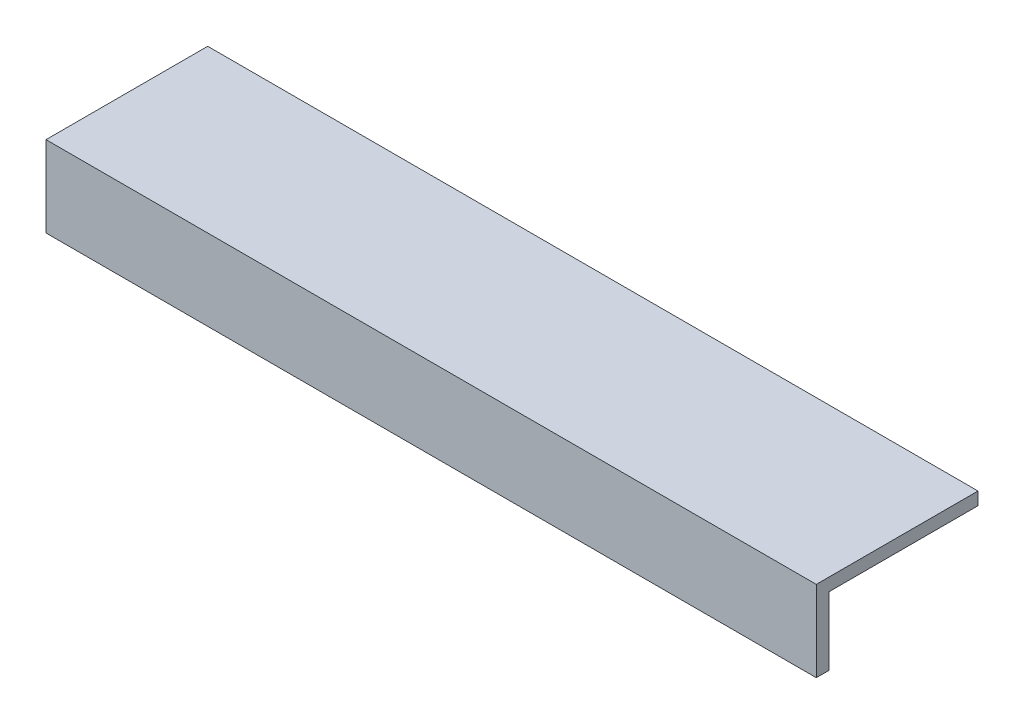
ISO-10303-21;
HEADER;
FILE_DESCRIPTION(('STEP AP214'),'2;1');
FILE_NAME('part.step','',(''),(''),'','','');
FILE_SCHEMA(('AUTOMOTIVE_DESIGN { 1 0 10303 214 1 1 1 1 }'));
ENDSEC;
DATA;
#1=APPLICATION_CONTEXT('core data for automotive mechanical design processes');
#2=APPLICATION_PROTOCOL_DEFINITION('international standard','automotive_design',2000,#1);
#3=PRODUCT_CONTEXT('',#1,'mechanical');
#4=PRODUCT('Part','Part','',(#3));
#5=PRODUCT_RELATED_PRODUCT_CATEGORY('part','',(#4));
#6=PRODUCT_DEFINITION_FORMATION('','',#4);
#7=PRODUCT_DEFINITION_CONTEXT('part definition',#1,'design');
#8=PRODUCT_DEFINITION('design','',#6,#7);
#9=PRODUCT_DEFINITION_SHAPE('','',#8);
#10=(LENGTH_UNIT() NAMED_UNIT(*) SI_UNIT(.MILLI.,.METRE.));
#11=(NAMED_UNIT(*) PLANE_ANGLE_UNIT() SI_UNIT($,.RADIAN.));
#12=(NAMED_UNIT(*) SI_UNIT($,.STERADIAN.) SOLID_ANGLE_UNIT());
#13=UNCERTAINTY_MEASURE_WITH_UNIT(LENGTH_MEASURE(1.E-05),#10,'distance_accuracy_value','');
#14=(GEOMETRIC_REPRESENTATION_CONTEXT(3) GLOBAL_UNCERTAINTY_ASSIGNED_CONTEXT((#13)) GLOBAL_UNIT_ASSIGNED_CONTEXT((#10,
#11,#12)) REPRESENTATION_CONTEXT('',''));
#15=CARTESIAN_POINT('',(0.,0.,0.));
#16=DIRECTION('',(0.,0.,1.));
#17=DIRECTION('',(1.,0.,0.));
#18=AXIS2_PLACEMENT_3D('',#15,#16,#17);
#19=CARTESIAN_POINT('',(181.000000000002,-7.49400541621981E-13,0.));
#20=DIRECTION('',(0.,-0.999999999999991,0.));
#21=DIRECTION('',(0.,0.,-0.99999999999999));
#22=AXIS2_PLACEMENT_3D('',#19,#20,#21);
#23=PLANE('',#22);
#24=DIRECTION('',(0.,0.,0.99999999999999));
#25=VECTOR('',#24,1.);
#26=CARTESIAN_POINT('',(0.,0.,0.));
#27=LINE('',#26,#25);
#28=CARTESIAN_POINT('',(-2.4980018054066E-13,-3.33066907387547E-13,-38.0000000000003));
#29=VERTEX_POINT('',#28);
#30=CARTESIAN_POINT('',(0.,0.,0.));
#31=VERTEX_POINT('',#30);
#32=EDGE_CURVE('E121',#29,#31,#27,.T.);
#33=ORIENTED_EDGE('',*,*,#32,.T.);
#34=DIRECTION('',(-0.999999999999998,0.,0.));
#35=VECTOR('',#34,1.);
#36=CARTESIAN_POINT('',(181.000000000002,-7.49400541621981E-13,0.));
#37=LINE('',#36,#35);
#38=CARTESIAN_POINT('',(181.000000000002,-7.49400541621981E-13,0.));
#39=VERTEX_POINT('',#38);
#40=EDGE_CURVE('E11',#39,#31,#37,.T.);
#41=ORIENTED_EDGE('',*,*,#40,.F.);
#42=DIRECTION('',(0.,0.,0.99999999999999));
#43=VECTOR('',#42,1.);
#44=CARTESIAN_POINT('',(181.000000000002,-7.49400541621981E-13,0.));
#45=LINE('',#44,#43);
#46=CARTESIAN_POINT('',(181.,-1.94289029309402E-13,-38.0000000000002));
#47=VERTEX_POINT('',#46);
#48=EDGE_CURVE('E110',#47,#39,#45,.T.);
#49=ORIENTED_EDGE('',*,*,#48,.F.);
#50=DIRECTION('',(-0.999999999999998,0.,0.));
#51=VECTOR('',#50,1.);
#52=CARTESIAN_POINT('',(181.,-1.94289029309402E-13,-38.0000000000002));
#53=LINE('',#52,#51);
#54=EDGE_CURVE('E120',#47,#29,#53,.T.);
#55=ORIENTED_EDGE('',*,*,#54,.T.);
#56=EDGE_LOOP('',(#33,#41,#49,#55));
#57=FACE_BOUND('',#56,.T.);
#58=ADVANCED_FACE('F38',(#57),#23,.F.);
#59=CARTESIAN_POINT('',(181.000000000002,-7.49400541621981E-13,0.));
#60=DIRECTION('',(0.,0.,-0.99999999999999));
#61=DIRECTION('',(-0.999999999999998,0.,0.));
#62=AXIS2_PLACEMENT_3D('',#59,#60,#61);
#63=PLANE('',#62);
#64=DIRECTION('',(0.,-0.999999999999991,0.));
#65=VECTOR('',#64,1.);
#66=CARTESIAN_POINT('',(0.,0.,0.));
#67=LINE('',#66,#65);
#68=CARTESIAN_POINT('',(0.,-18.9999999999999,-1.11022302462516E-13));
#69=VERTEX_POINT('',#68);
#70=EDGE_CURVE('E106',#31,#69,#67,.T.);
#71=ORIENTED_EDGE('',*,*,#70,.T.);
#72=DIRECTION('',(-0.999999999999998,0.,0.));
#73=VECTOR('',#72,1.);
#74=CARTESIAN_POINT('',(0.,-18.9999999999999,-1.11022302462516E-13));
#75=LINE('',#74,#73);
#76=CARTESIAN_POINT('',(181.000000000001,-19.0000000000003,1.66533453693773E-13));
#77=VERTEX_POINT('',#76);
#78=EDGE_CURVE('E52',#77,#69,#75,.T.);
#79=ORIENTED_EDGE('',*,*,#78,.F.);
#80=DIRECTION('',(0.,-0.999999999999991,0.));
#81=VECTOR('',#80,1.);
#82=CARTESIAN_POINT('',(181.000000000002,-7.49400541621981E-13,0.));
#83=LINE('',#82,#81);
#84=EDGE_CURVE('E88',#39,#77,#83,.T.);
#85=ORIENTED_EDGE('',*,*,#84,.F.);
#86=ORIENTED_EDGE('',*,*,#40,.T.);
#87=EDGE_LOOP('',(#71,#79,#85,#86));
#88=FACE_BOUND('',#87,.T.);
#89=ADVANCED_FACE('F105',(#88),#63,.F.);
#90=CARTESIAN_POINT('',(181.,-2.99999999999992,-2.99999999999989));
#91=DIRECTION('',(0.,0.,0.99999999999999));
#92=DIRECTION('',(0.999999999999998,0.,0.));
#93=AXIS2_PLACEMENT_3D('',#90,#91,#92);
#94=PLANE('',#93);
#95=DIRECTION('',(0.,0.999999999999991,0.));
#96=VECTOR('',#95,1.);
#97=CARTESIAN_POINT('',(181.,-2.99999999999992,-2.99999999999989));
#98=LINE('',#97,#96);
#99=CARTESIAN_POINT('',(181.,-18.9999999999998,-3.00000000000017));
#100=VERTEX_POINT('',#99);
#101=CARTESIAN_POINT('',(181.,-2.99999999999992,-2.99999999999989));
#102=VERTEX_POINT('',#101);
#103=EDGE_CURVE('E112',#100,#102,#98,.T.);
#104=ORIENTED_EDGE('',*,*,#103,.F.);
#105=DIRECTION('',(0.999999999999998,0.,0.));
#106=VECTOR('',#105,1.);
#107=CARTESIAN_POINT('',(0.,-19.,-2.99999999999995));
#108=LINE('',#107,#106);
#109=CARTESIAN_POINT('',(0.,-19.,-2.99999999999995));
#110=VERTEX_POINT('',#109);
#111=EDGE_CURVE('E100',#110,#100,#108,.T.);
#112=ORIENTED_EDGE('',*,*,#111,.F.);
#113=DIRECTION('',(0.,0.999999999999991,0.));
#114=VECTOR('',#113,1.);
#115=CARTESIAN_POINT('',(0.,-3.00000000000031,-3.00000000000028));
#116=LINE('',#115,#114);
#117=CARTESIAN_POINT('',(0.,-3.00000000000031,-3.00000000000028));
#118=VERTEX_POINT('',#117);
#119=EDGE_CURVE('E125',#110,#118,#116,.T.);
#120=ORIENTED_EDGE('',*,*,#119,.T.);
#121=DIRECTION('',(-0.999999999999998,0.,0.));
#122=VECTOR('',#121,1.);
#123=CARTESIAN_POINT('',(181.,-2.99999999999992,-2.99999999999989));
#124=LINE('',#123,#122);
#125=EDGE_CURVE('E45',#102,#118,#124,.T.);
#126=ORIENTED_EDGE('',*,*,#125,.F.);
#127=EDGE_LOOP('',(#104,#112,#120,#126));
#128=FACE_BOUND('',#127,.T.);
#129=ADVANCED_FACE('F153',(#128),#94,.F.);
#130=CARTESIAN_POINT('',(181.,-2.99999999999992,-2.99999999999989));
#131=DIRECTION('',(0.,0.999999999999991,0.));
#132=DIRECTION('',(0.,0.,0.99999999999999));
#133=AXIS2_PLACEMENT_3D('',#130,#131,#132);
#134=PLANE('',#133);
#135=DIRECTION('',(0.,0.,-0.99999999999999));
#136=VECTOR('',#135,1.);
#137=CARTESIAN_POINT('',(0.,-3.00000000000031,-3.00000000000028));
#138=LINE('',#137,#136);
#139=CARTESIAN_POINT('',(-1.38777878078145E-13,-3.00000000000009,-38.));
#140=VERTEX_POINT('',#139);
#141=EDGE_CURVE('E127',#118,#140,#138,.T.);
#142=ORIENTED_EDGE('',*,*,#141,.T.);
#143=DIRECTION('',(-0.999999999999998,0.,0.));
#144=VECTOR('',#143,1.);
#145=CARTESIAN_POINT('',(181.,-3.00000000000014,-38.0000000000001));
#146=LINE('',#145,#144);
#147=CARTESIAN_POINT('',(181.,-3.00000000000014,-38.0000000000001));
#148=VERTEX_POINT('',#147);
#149=EDGE_CURVE('E131',#148,#140,#146,.T.);
#150=ORIENTED_EDGE('',*,*,#149,.F.);
#151=DIRECTION('',(0.,0.,-0.99999999999999));
#152=VECTOR('',#151,1.);
#153=CARTESIAN_POINT('',(181.,-2.99999999999992,-2.99999999999989));
#154=LINE('',#153,#152);
#155=EDGE_CURVE('E114',#102,#148,#154,.T.);
#156=ORIENTED_EDGE('',*,*,#155,.F.);
#157=ORIENTED_EDGE('',*,*,#125,.T.);
#158=EDGE_LOOP('',(#142,#150,#156,#157));
#159=FACE_BOUND('',#158,.T.);
#160=ADVANCED_FACE('F137',(#159),#134,.F.);
#161=CARTESIAN_POINT('',(181.,-1.94289029309402E-13,-38.0000000000002));
#162=DIRECTION('',(0.,0.,0.99999999999999));
#163=DIRECTION('',(0.999999999999998,0.,0.));
#164=AXIS2_PLACEMENT_3D('',#161,#162,#163);
#165=PLANE('',#164);
#166=DIRECTION('',(0.,0.999999999999991,0.));
#167=VECTOR('',#166,1.);
#168=CARTESIAN_POINT('',(-2.4980018054066E-13,-3.33066907387547E-13,-38.0000000000003));
#169=LINE('',#168,#167);
#170=EDGE_CURVE('E82',#140,#29,#169,.T.);
#171=ORIENTED_EDGE('',*,*,#170,.T.);
#172=ORIENTED_EDGE('',*,*,#54,.F.);
#173=DIRECTION('',(0.,0.999999999999991,0.));
#174=VECTOR('',#173,1.);
#175=CARTESIAN_POINT('',(181.,-1.94289029309402E-13,-38.0000000000002));
#176=LINE('',#175,#174);
#177=EDGE_CURVE('E61',#148,#47,#176,.T.);
#178=ORIENTED_EDGE('',*,*,#177,.F.);
#179=ORIENTED_EDGE('',*,*,#149,.T.);
#180=EDGE_LOOP('',(#171,#172,#178,#179));
#181=FACE_BOUND('',#180,.T.);
#182=ADVANCED_FACE('F145',(#181),#165,.F.);
#183=CARTESIAN_POINT('',(181.000000000002,-7.49400541621981E-13,0.));
#184=DIRECTION('',(-0.999999999999998,0.,0.));
#185=DIRECTION('',(0.,0.,0.99999999999999));
#186=AXIS2_PLACEMENT_3D('',#183,#184,#185);
#187=PLANE('',#186);
#188=ORIENTED_EDGE('',*,*,#84,.T.);
#189=DIRECTION('',(0.,0.,0.99999999999999));
#190=VECTOR('',#189,1.);
#191=CARTESIAN_POINT('',(181.,-19.0000000000005,-184.994505411564));
#192=LINE('',#191,#190);
#193=EDGE_CURVE('E97',#100,#77,#192,.T.);
#194=ORIENTED_EDGE('',*,*,#193,.F.);
#195=ORIENTED_EDGE('',*,*,#103,.T.);
#196=ORIENTED_EDGE('',*,*,#155,.T.);
#197=ORIENTED_EDGE('',*,*,#177,.T.);
#198=ORIENTED_EDGE('',*,*,#48,.T.);
#199=EDGE_LOOP('',(#188,#194,#195,#196,#197,#198));
#200=FACE_BOUND('',#199,.T.);
#201=ADVANCED_FACE('F108',(#200),#187,.F.);
#202=CARTESIAN_POINT('',(0.,0.,0.));
#203=DIRECTION('',(-0.999999999999998,0.,0.));
#204=DIRECTION('',(0.,0.,0.99999999999999));
#205=AXIS2_PLACEMENT_3D('',#202,#203,#204);
#206=PLANE('',#205);
#207=DIRECTION('',(0.,0.,0.99999999999999));
#208=VECTOR('',#207,1.);
#209=CARTESIAN_POINT('',(0.,-18.9999999999999,-184.994505411564));
#210=LINE('',#209,#208);
#211=EDGE_CURVE('E102',#110,#69,#210,.T.);
#212=ORIENTED_EDGE('',*,*,#211,.T.);
#213=ORIENTED_EDGE('',*,*,#70,.F.);
#214=ORIENTED_EDGE('',*,*,#32,.F.);
#215=ORIENTED_EDGE('',*,*,#170,.F.);
#216=ORIENTED_EDGE('',*,*,#141,.F.);
#217=ORIENTED_EDGE('',*,*,#119,.F.);
#218=EDGE_LOOP('',(#212,#213,#214,#215,#216,#217));
#219=FACE_BOUND('',#218,.T.);
#220=ADVANCED_FACE('F142',(#219),#206,.T.);
#221=CARTESIAN_POINT('',(0.,-18.9999999999999,-184.994505411564));
#222=DIRECTION('',(0.,0.999999999999991,0.));
#223=DIRECTION('',(0.,0.,0.99999999999999));
#224=AXIS2_PLACEMENT_3D('',#221,#222,#223);
#225=PLANE('',#224);
#226=ORIENTED_EDGE('',*,*,#111,.T.);
#227=ORIENTED_EDGE('',*,*,#193,.T.);
#228=ORIENTED_EDGE('',*,*,#78,.T.);
#229=ORIENTED_EDGE('',*,*,#211,.F.);
#230=EDGE_LOOP('',(#226,#227,#228,#229));
#231=FACE_BOUND('',#230,.T.);
#232=ADVANCED_FACE('F98',(#231),#225,.F.);
#233=CLOSED_SHELL('',(#58,#89,#129,#160,#182,#201,#220,#232));
#234=MANIFOLD_SOLID_BREP('B2',#233);
#235=ADVANCED_BREP_SHAPE_REPRESENTATION('',(#18,#234),#14);
#236=SHAPE_DEFINITION_REPRESENTATION(#9,#235);
ENDSEC;
END-ISO-10303-21;
